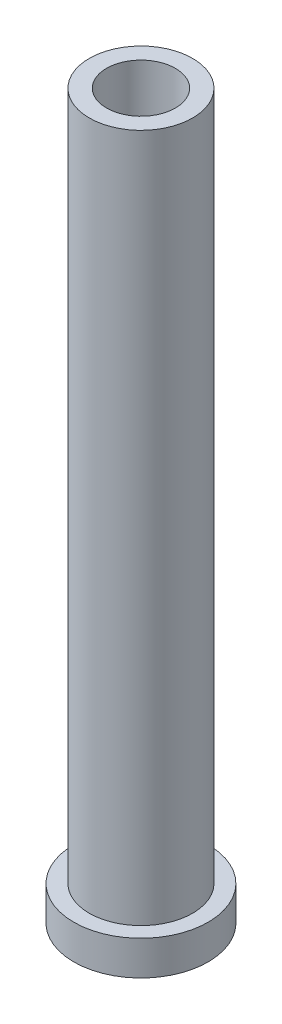
ISO-10303-21;
HEADER;
FILE_DESCRIPTION(('STEP AP214'),'2;1');
FILE_NAME('part.step','',(''),(''),'','','');
FILE_SCHEMA(('AUTOMOTIVE_DESIGN { 1 0 10303 214 1 1 1 1 }'));
ENDSEC;
DATA;
#1=APPLICATION_CONTEXT('core data for automotive mechanical design processes');
#2=APPLICATION_PROTOCOL_DEFINITION('international standard','automotive_design',2000,#1);
#3=PRODUCT_CONTEXT('',#1,'mechanical');
#4=PRODUCT('Part','Part','',(#3));
#5=PRODUCT_RELATED_PRODUCT_CATEGORY('part','',(#4));
#6=PRODUCT_DEFINITION_FORMATION('','',#4);
#7=PRODUCT_DEFINITION_CONTEXT('part definition',#1,'design');
#8=PRODUCT_DEFINITION('design','',#6,#7);
#9=PRODUCT_DEFINITION_SHAPE('','',#8);
#10=(LENGTH_UNIT() NAMED_UNIT(*) SI_UNIT(.MILLI.,.METRE.));
#11=(NAMED_UNIT(*) PLANE_ANGLE_UNIT() SI_UNIT($,.RADIAN.));
#12=(NAMED_UNIT(*) SI_UNIT($,.STERADIAN.) SOLID_ANGLE_UNIT());
#13=UNCERTAINTY_MEASURE_WITH_UNIT(LENGTH_MEASURE(1.E-05),#10,'distance_accuracy_value','');
#14=(GEOMETRIC_REPRESENTATION_CONTEXT(3) GLOBAL_UNCERTAINTY_ASSIGNED_CONTEXT((#13)) GLOBAL_UNIT_ASSIGNED_CONTEXT((#10,
#11,#12)) REPRESENTATION_CONTEXT('',''));
#15=CARTESIAN_POINT('',(0.,0.,0.));
#16=DIRECTION('',(0.,0.,1.));
#17=DIRECTION('',(1.,0.,0.));
#18=AXIS2_PLACEMENT_3D('',#15,#16,#17);
#19=CARTESIAN_POINT('',(0.,-2.,0.));
#20=DIRECTION('',(0.,1.,0.));
#21=DIRECTION('',(0.,0.,1.));
#22=AXIS2_PLACEMENT_3D('',#19,#20,#21);
#23=CYLINDRICAL_SURFACE('',#22,3.9);
#24=CARTESIAN_POINT('',(0.,-2.,0.));
#25=DIRECTION('',(0.,1.,0.));
#26=DIRECTION('',(0.,0.,1.));
#27=AXIS2_PLACEMENT_3D('',#24,#25,#26);
#28=CIRCLE('',#27,3.9);
#29=CARTESIAN_POINT('',(0.,-2.,3.9));
#30=VERTEX_POINT('',#29);
#31=EDGE_CURVE('E45',#30,#30,#28,.T.);
#32=ORIENTED_EDGE('',*,*,#31,.T.);
#33=EDGE_LOOP('',(#32));
#34=FACE_BOUND('',#33,.T.);
#35=CARTESIAN_POINT('',(0.,0.,0.));
#36=DIRECTION('',(0.,1.,0.));
#37=DIRECTION('',(0.,0.,1.));
#38=AXIS2_PLACEMENT_3D('',#35,#36,#37);
#39=CIRCLE('',#38,3.9);
#40=CARTESIAN_POINT('',(0.,0.,3.9));
#41=VERTEX_POINT('',#40);
#42=EDGE_CURVE('E40',#41,#41,#39,.T.);
#43=ORIENTED_EDGE('',*,*,#42,.F.);
#44=EDGE_LOOP('',(#43));
#45=FACE_BOUND('',#44,.T.);
#46=ADVANCED_FACE('F37',(#34,#45),#23,.T.);
#47=CARTESIAN_POINT('',(0.,-2.,0.));
#48=DIRECTION('',(0.,1.,0.));
#49=DIRECTION('',(0.,0.,1.));
#50=AXIS2_PLACEMENT_3D('',#47,#48,#49);
#51=PLANE('',#50);
#52=ORIENTED_EDGE('',*,*,#31,.F.);
#53=EDGE_LOOP('',(#52));
#54=FACE_BOUND('',#53,.T.);
#55=ADVANCED_FACE('F86',(#54),#51,.F.);
#56=CARTESIAN_POINT('',(0.,0.,0.));
#57=DIRECTION('',(0.,1.,0.));
#58=DIRECTION('',(0.,0.,1.));
#59=AXIS2_PLACEMENT_3D('',#56,#57,#58);
#60=PLANE('',#59);
#61=CARTESIAN_POINT('',(0.,0.,0.));
#62=DIRECTION('',(0.,1.,0.));
#63=DIRECTION('',(0.,0.,1.));
#64=AXIS2_PLACEMENT_3D('',#61,#62,#63);
#65=CIRCLE('',#64,3.);
#66=CARTESIAN_POINT('',(0.,0.,3.));
#67=VERTEX_POINT('',#66);
#68=EDGE_CURVE('E10',#67,#67,#65,.T.);
#69=ORIENTED_EDGE('',*,*,#68,.F.);
#70=EDGE_LOOP('',(#69));
#71=FACE_BOUND('',#70,.T.);
#72=ORIENTED_EDGE('',*,*,#42,.T.);
#73=EDGE_LOOP('',(#72));
#74=FACE_BOUND('',#73,.T.);
#75=ADVANCED_FACE('F81',(#71,#74),#60,.T.);
#76=CARTESIAN_POINT('',(0.,40.,0.));
#77=DIRECTION('',(0.,-1.,0.));
#78=DIRECTION('',(0.,0.,-1.));
#79=AXIS2_PLACEMENT_3D('',#76,#77,#78);
#80=CYLINDRICAL_SURFACE('',#79,3.);
#81=CARTESIAN_POINT('',(0.,40.,0.));
#82=DIRECTION('',(0.,1.,0.));
#83=DIRECTION('',(0.,0.,1.));
#84=AXIS2_PLACEMENT_3D('',#81,#82,#83);
#85=CIRCLE('',#84,3.);
#86=CARTESIAN_POINT('',(0.,40.,3.));
#87=VERTEX_POINT('',#86);
#88=EDGE_CURVE('E52',#87,#87,#85,.T.);
#89=ORIENTED_EDGE('',*,*,#88,.F.);
#90=EDGE_LOOP('',(#89));
#91=FACE_BOUND('',#90,.T.);
#92=ORIENTED_EDGE('',*,*,#68,.T.);
#93=EDGE_LOOP('',(#92));
#94=FACE_BOUND('',#93,.T.);
#95=ADVANCED_FACE('F76',(#91,#94),#80,.T.);
#96=CARTESIAN_POINT('',(0.,40.,0.));
#97=DIRECTION('',(0.,1.,0.));
#98=DIRECTION('',(0.,0.,1.));
#99=AXIS2_PLACEMENT_3D('',#96,#97,#98);
#100=PLANE('',#99);
#101=CARTESIAN_POINT('',(0.,40.,0.));
#102=DIRECTION('',(0.,1.,0.));
#103=DIRECTION('',(0.,0.,1.));
#104=AXIS2_PLACEMENT_3D('',#101,#102,#103);
#105=CIRCLE('',#104,2.);
#106=CARTESIAN_POINT('',(0.,40.,2.));
#107=VERTEX_POINT('',#106);
#108=EDGE_CURVE('E57',#107,#107,#105,.T.);
#109=ORIENTED_EDGE('',*,*,#108,.F.);
#110=EDGE_LOOP('',(#109));
#111=FACE_BOUND('',#110,.T.);
#112=ORIENTED_EDGE('',*,*,#88,.T.);
#113=EDGE_LOOP('',(#112));
#114=FACE_BOUND('',#113,.T.);
#115=ADVANCED_FACE('F70',(#111,#114),#100,.T.);
#116=CARTESIAN_POINT('',(0.,35.,0.));
#117=DIRECTION('',(0.,1.,0.));
#118=DIRECTION('',(0.,0.,1.));
#119=AXIS2_PLACEMENT_3D('',#116,#117,#118);
#120=CYLINDRICAL_SURFACE('',#119,2.);
#121=CARTESIAN_POINT('',(0.,35.,0.));
#122=DIRECTION('',(0.,1.,0.));
#123=DIRECTION('',(0.,0.,1.));
#124=AXIS2_PLACEMENT_3D('',#121,#122,#123);
#125=CIRCLE('',#124,2.);
#126=CARTESIAN_POINT('',(0.,35.,2.));
#127=VERTEX_POINT('',#126);
#128=EDGE_CURVE('E56',#127,#127,#125,.T.);
#129=ORIENTED_EDGE('',*,*,#128,.F.);
#130=EDGE_LOOP('',(#129));
#131=FACE_BOUND('',#130,.T.);
#132=ORIENTED_EDGE('',*,*,#108,.T.);
#133=EDGE_LOOP('',(#132));
#134=FACE_BOUND('',#133,.T.);
#135=ADVANCED_FACE('F67',(#131,#134),#120,.F.);
#136=CARTESIAN_POINT('',(0.,35.,0.));
#137=DIRECTION('',(0.,1.,0.));
#138=DIRECTION('',(0.,0.,1.));
#139=AXIS2_PLACEMENT_3D('',#136,#137,#138);
#140=PLANE('',#139);
#141=ORIENTED_EDGE('',*,*,#128,.T.);
#142=EDGE_LOOP('',(#141));
#143=FACE_BOUND('',#142,.T.);
#144=ADVANCED_FACE('F65',(#143),#140,.T.);
#145=CLOSED_SHELL('',(#46,#55,#75,#95,#115,#135,#144));
#146=MANIFOLD_SOLID_BREP('B2',#145);
#147=ADVANCED_BREP_SHAPE_REPRESENTATION('',(#18,#146),#14);
#148=SHAPE_DEFINITION_REPRESENTATION(#9,#147);
ENDSEC;
END-ISO-10303-21;
